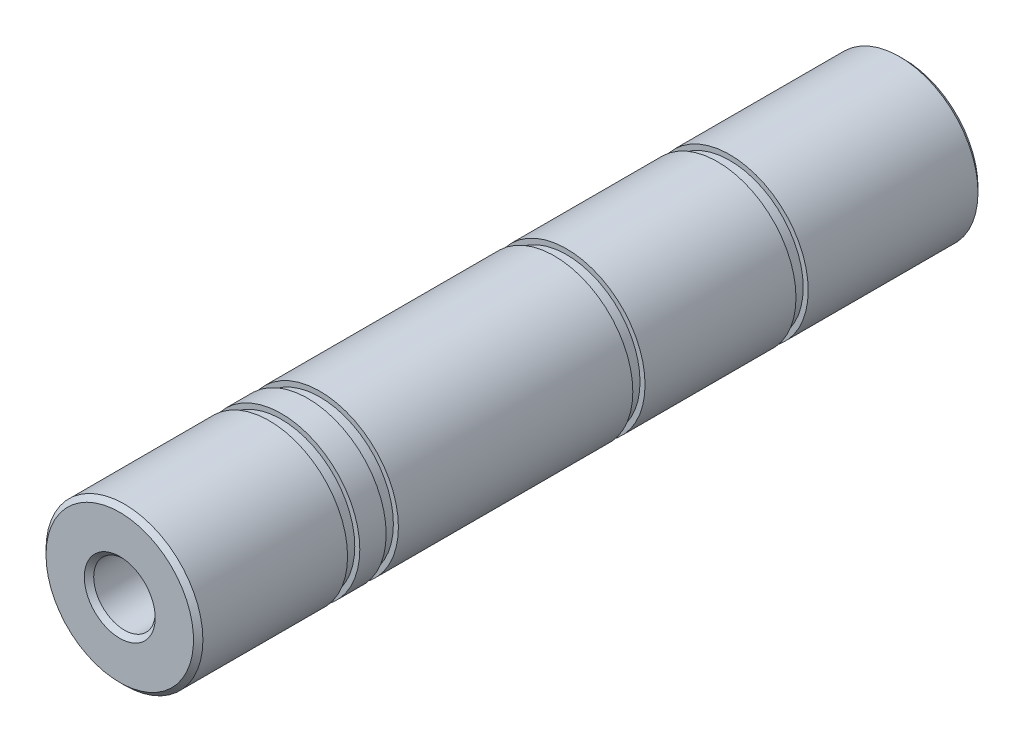
ISO-10303-21;
HEADER;
FILE_DESCRIPTION(('STEP AP214'),'2;1');
FILE_NAME('part.step','',(''),(''),'','','');
FILE_SCHEMA(('AUTOMOTIVE_DESIGN { 1 0 10303 214 1 1 1 1 }'));
ENDSEC;
DATA;
#1=APPLICATION_CONTEXT('core data for automotive mechanical design processes');
#2=APPLICATION_PROTOCOL_DEFINITION('international standard','automotive_design',2000,#1);
#3=PRODUCT_CONTEXT('',#1,'mechanical');
#4=PRODUCT('Part','Part','',(#3));
#5=PRODUCT_RELATED_PRODUCT_CATEGORY('part','',(#4));
#6=PRODUCT_DEFINITION_FORMATION('','',#4);
#7=PRODUCT_DEFINITION_CONTEXT('part definition',#1,'design');
#8=PRODUCT_DEFINITION('design','',#6,#7);
#9=PRODUCT_DEFINITION_SHAPE('','',#8);
#10=(LENGTH_UNIT() NAMED_UNIT(*) SI_UNIT(.MILLI.,.METRE.));
#11=(NAMED_UNIT(*) PLANE_ANGLE_UNIT() SI_UNIT($,.RADIAN.));
#12=(NAMED_UNIT(*) SI_UNIT($,.STERADIAN.) SOLID_ANGLE_UNIT());
#13=UNCERTAINTY_MEASURE_WITH_UNIT(LENGTH_MEASURE(1.E-05),#10,'distance_accuracy_value','');
#14=(GEOMETRIC_REPRESENTATION_CONTEXT(3) GLOBAL_UNCERTAINTY_ASSIGNED_CONTEXT((#13)) GLOBAL_UNIT_ASSIGNED_CONTEXT((#10,
#11,#12)) REPRESENTATION_CONTEXT('',''));
#15=CARTESIAN_POINT('',(0.,0.,0.));
#16=DIRECTION('',(0.,0.,1.));
#17=DIRECTION('',(1.,0.,0.));
#18=AXIS2_PLACEMENT_3D('',#15,#16,#17);
#19=CARTESIAN_POINT('',(0.,0.,44.4500000013477));
#20=DIRECTION('',(0.,0.,1.));
#21=DIRECTION('',(1.,0.,0.));
#22=AXIS2_PLACEMENT_3D('',#19,#20,#21);
#23=CONICAL_SURFACE('',#22,2.4891999989336,1.02974425733867);
#24=CARTESIAN_POINT('',(-2.27373675443232E-10,0.,42.954337744959));
#25=VERTEX_POINT('',#24);
#26=VERTEX_LOOP('',#25);
#27=FACE_BOUND('',#26,.T.);
#28=CARTESIAN_POINT('',(0.,0.,44.45));
#29=DIRECTION('',(0.,0.,1.));
#30=DIRECTION('',(1.,0.,0.));
#31=AXIS2_PLACEMENT_3D('',#28,#29,#30);
#32=CIRCLE('',#31,2.4892);
#33=CARTESIAN_POINT('',(2.4892,0.,44.45));
#34=VERTEX_POINT('',#33);
#35=EDGE_CURVE('E37',#34,#34,#32,.T.);
#36=ORIENTED_EDGE('',*,*,#35,.T.);
#37=EDGE_LOOP('',(#36));
#38=FACE_BOUND('',#37,.T.);
#39=ADVANCED_FACE('F17',(#27,#38),#23,.F.);
#40=CARTESIAN_POINT('',(0.,0.,19.0499999985718));
#41=DIRECTION('',(0.,0.,-1.));
#42=DIRECTION('',(-1.,0.,0.));
#43=AXIS2_PLACEMENT_3D('',#40,#41,#42);
#44=CONICAL_SURFACE('',#43,2.48919999899044,1.02974425739578);
#45=CARTESIAN_POINT('',(1.13686837721616E-10,0.,20.5456622549036));
#46=VERTEX_POINT('',#45);
#47=VERTEX_LOOP('',#46);
#48=FACE_BOUND('',#47,.T.);
#49=CARTESIAN_POINT('',(0.,0.,19.05));
#50=DIRECTION('',(0.,0.,-1.));
#51=DIRECTION('',(-1.,0.,0.));
#52=AXIS2_PLACEMENT_3D('',#49,#50,#51);
#53=CIRCLE('',#52,2.4892);
#54=CARTESIAN_POINT('',(-2.4892,0.,19.05));
#55=VERTEX_POINT('',#54);
#56=EDGE_CURVE('E39',#55,#55,#53,.T.);
#57=ORIENTED_EDGE('',*,*,#56,.T.);
#58=EDGE_LOOP('',(#57));
#59=FACE_BOUND('',#58,.T.);
#60=ADVANCED_FACE('F34',(#48,#59),#44,.F.);
#61=CARTESIAN_POINT('',(0.,0.,53.975));
#62=DIRECTION('',(0.,0.,1.));
#63=DIRECTION('',(1.,0.,0.));
#64=AXIS2_PLACEMENT_3D('',#61,#62,#63);
#65=CYLINDRICAL_SURFACE('',#64,2.4892);
#66=CARTESIAN_POINT('',(0.,0.,63.1189999999151));
#67=DIRECTION('',(0.,0.,1.));
#68=DIRECTION('',(-1.,0.,0.));
#69=AXIS2_PLACEMENT_3D('',#66,#67,#68);
#70=CIRCLE('',#69,2.48920000018416);
#71=CARTESIAN_POINT('',(-2.48920000018416,0.,63.1189999999151));
#72=VERTEX_POINT('',#71);
#73=EDGE_CURVE('E42',#72,#72,#70,.T.);
#74=ORIENTED_EDGE('',*,*,#73,.T.);
#75=EDGE_LOOP('',(#74));
#76=FACE_BOUND('',#75,.T.);
#77=ORIENTED_EDGE('',*,*,#35,.F.);
#78=EDGE_LOOP('',(#77));
#79=FACE_BOUND('',#78,.T.);
#80=ADVANCED_FACE('F368',(#76,#79),#65,.F.);
#81=CARTESIAN_POINT('',(0.,0.,9.525));
#82=DIRECTION('',(0.,0.,-1.));
#83=DIRECTION('',(-1.,0.,0.));
#84=AXIS2_PLACEMENT_3D('',#81,#82,#83);
#85=CYLINDRICAL_SURFACE('',#84,2.4892);
#86=CARTESIAN_POINT('',(0.,0.,0.381000000118092));
#87=DIRECTION('',(0.,0.,-1.));
#88=DIRECTION('',(1.,0.,0.));
#89=AXIS2_PLACEMENT_3D('',#86,#87,#88);
#90=CIRCLE('',#89,2.48920000012731);
#91=CARTESIAN_POINT('',(2.48920000012731,0.,0.381000000118092));
#92=VERTEX_POINT('',#91);
#93=EDGE_CURVE('E105',#92,#92,#90,.T.);
#94=ORIENTED_EDGE('',*,*,#93,.T.);
#95=EDGE_LOOP('',(#94));
#96=FACE_BOUND('',#95,.T.);
#97=ORIENTED_EDGE('',*,*,#56,.F.);
#98=EDGE_LOOP('',(#97));
#99=FACE_BOUND('',#98,.T.);
#100=ADVANCED_FACE('F360',(#96,#99),#85,.F.);
#101=CARTESIAN_POINT('',(0.,0.,63.5000000002037));
#102=DIRECTION('',(0.,0.,1.));
#103=DIRECTION('',(1.,0.,0.));
#104=AXIS2_PLACEMENT_3D('',#101,#102,#103);
#105=CONICAL_SURFACE('',#104,2.87019999979066,0.785398162502276);
#106=CARTESIAN_POINT('',(0.,0.,63.5000000002037));
#107=DIRECTION('',(0.,0.,1.));
#108=DIRECTION('',(1.,0.,0.));
#109=AXIS2_PLACEMENT_3D('',#106,#107,#108);
#110=CIRCLE('',#109,2.87019999979066);
#111=CARTESIAN_POINT('',(2.87019999979066,0.,63.5000000002037));
#112=VERTEX_POINT('',#111);
#113=EDGE_CURVE('E20',#112,#112,#110,.T.);
#114=ORIENTED_EDGE('',*,*,#113,.T.);
#115=EDGE_LOOP('',(#114));
#116=FACE_BOUND('',#115,.T.);
#117=ORIENTED_EDGE('',*,*,#73,.F.);
#118=EDGE_LOOP('',(#117));
#119=FACE_BOUND('',#118,.T.);
#120=ADVANCED_FACE('F351',(#116,#119),#105,.F.);
#121=CARTESIAN_POINT('',(0.,0.,-2.8421709430404E-10));
#122=DIRECTION('',(0.,0.,-1.));
#123=DIRECTION('',(-1.,0.,0.));
#124=AXIS2_PLACEMENT_3D('',#121,#122,#123);
#125=CONICAL_SURFACE('',#124,2.8701999998475,0.785398162502276);
#126=CARTESIAN_POINT('',(0.,0.,-2.27373675443232E-10));
#127=DIRECTION('',(0.,0.,-1.));
#128=DIRECTION('',(-1.,0.,0.));
#129=AXIS2_PLACEMENT_3D('',#126,#127,#128);
#130=CIRCLE('',#129,2.87019999979066);
#131=CARTESIAN_POINT('',(-2.87019999979066,0.,-2.27373675443232E-10));
#132=VERTEX_POINT('',#131);
#133=EDGE_CURVE('E100',#132,#132,#130,.F.);
#134=ORIENTED_EDGE('',*,*,#133,.F.);
#135=EDGE_LOOP('',(#134));
#136=FACE_BOUND('',#135,.T.);
#137=ORIENTED_EDGE('',*,*,#93,.F.);
#138=EDGE_LOOP('',(#137));
#139=FACE_BOUND('',#138,.T.);
#140=ADVANCED_FACE('F342',(#136,#139),#125,.F.);
#141=CARTESIAN_POINT('',(0.,0.,63.5));
#142=DIRECTION('',(0.,0.,-1.));
#143=DIRECTION('',(-1.,0.,0.));
#144=AXIS2_PLACEMENT_3D('',#141,#142,#143);
#145=PLANE('',#144);
#146=ORIENTED_EDGE('',*,*,#113,.F.);
#147=EDGE_LOOP('',(#146));
#148=FACE_BOUND('',#147,.T.);
#149=CARTESIAN_POINT('',(0.,0.,63.5000000001469));
#150=DIRECTION('',(0.,0.,-1.));
#151=DIRECTION('',(-1.,0.,0.));
#152=AXIS2_PLACEMENT_3D('',#149,#150,#151);
#153=CIRCLE('',#152,5.9690000002206);
#154=CARTESIAN_POINT('',(-5.9690000002206,0.,63.5000000001469));
#155=VERTEX_POINT('',#154);
#156=EDGE_CURVE('E98',#155,#155,#153,.T.);
#157=ORIENTED_EDGE('',*,*,#156,.F.);
#158=EDGE_LOOP('',(#157));
#159=FACE_BOUND('',#158,.T.);
#160=ADVANCED_FACE('F334',(#148,#159),#145,.F.);
#161=CARTESIAN_POINT('',(0.,0.,0.));
#162=DIRECTION('',(0.,0.,-1.));
#163=DIRECTION('',(-1.,0.,0.));
#164=AXIS2_PLACEMENT_3D('',#161,#162,#163);
#165=PLANE('',#164);
#166=ORIENTED_EDGE('',*,*,#133,.T.);
#167=EDGE_LOOP('',(#166));
#168=FACE_BOUND('',#167,.T.);
#169=CARTESIAN_POINT('',(0.,0.,-1.70530256582424E-10));
#170=DIRECTION('',(0.,0.,1.));
#171=DIRECTION('',(1.,0.,0.));
#172=AXIS2_PLACEMENT_3D('',#169,#170,#171);
#173=CIRCLE('',#172,5.9690000002206);
#174=CARTESIAN_POINT('',(5.9690000002206,0.,-1.70530256582424E-10));
#175=VERTEX_POINT('',#174);
#176=EDGE_CURVE('E94',#175,#175,#173,.T.);
#177=ORIENTED_EDGE('',*,*,#176,.F.);
#178=EDGE_LOOP('',(#177));
#179=FACE_BOUND('',#178,.T.);
#180=ADVANCED_FACE('F144',(#168,#179),#165,.T.);
#181=CARTESIAN_POINT('',(0.,0.,63.1189999999151));
#182=DIRECTION('',(0.,0.,-1.));
#183=DIRECTION('',(-1.,0.,0.));
#184=AXIS2_PLACEMENT_3D('',#181,#182,#183);
#185=CONICAL_SURFACE('',#184,6.34999999977026,0.785398162502276);
#186=CARTESIAN_POINT('',(0.,0.,63.119));
#187=DIRECTION('',(0.,0.,1.));
#188=DIRECTION('',(1.,0.,0.));
#189=AXIS2_PLACEMENT_3D('',#186,#187,#188);
#190=CIRCLE('',#189,6.35);
#191=CARTESIAN_POINT('',(6.35,0.,63.119));
#192=VERTEX_POINT('',#191);
#193=EDGE_CURVE('E97',#192,#192,#190,.F.);
#194=ORIENTED_EDGE('',*,*,#193,.F.);
#195=EDGE_LOOP('',(#194));
#196=FACE_BOUND('',#195,.T.);
#197=ORIENTED_EDGE('',*,*,#156,.T.);
#198=EDGE_LOOP('',(#197));
#199=FACE_BOUND('',#198,.T.);
#200=ADVANCED_FACE('F134',(#196,#199),#185,.T.);
#201=CARTESIAN_POINT('',(0.,0.,0.381000000174936));
#202=DIRECTION('',(0.,0.,1.));
#203=DIRECTION('',(1.,0.,0.));
#204=AXIS2_PLACEMENT_3D('',#201,#202,#203);
#205=CONICAL_SURFACE('',#204,6.34999999988395,0.785398162502276);
#206=ORIENTED_EDGE('',*,*,#176,.T.);
#207=EDGE_LOOP('',(#206));
#208=FACE_BOUND('',#207,.T.);
#209=CARTESIAN_POINT('',(0.,0.,0.381));
#210=DIRECTION('',(0.,0.,1.));
#211=DIRECTION('',(1.,0.,0.));
#212=AXIS2_PLACEMENT_3D('',#209,#210,#211);
#213=CIRCLE('',#212,6.35);
#214=CARTESIAN_POINT('',(6.35,0.,0.381));
#215=VERTEX_POINT('',#214);
#216=EDGE_CURVE('E93',#215,#215,#213,.T.);
#217=ORIENTED_EDGE('',*,*,#216,.F.);
#218=EDGE_LOOP('',(#217));
#219=FACE_BOUND('',#218,.T.);
#220=ADVANCED_FACE('F131',(#208,#219),#205,.T.);
#221=CARTESIAN_POINT('',(0.,0.,0.));
#222=DIRECTION('',(0.,0.,1.));
#223=DIRECTION('',(1.,0.,0.));
#224=AXIS2_PLACEMENT_3D('',#221,#222,#223);
#225=CYLINDRICAL_SURFACE('',#224,6.35);
#226=ORIENTED_EDGE('',*,*,#193,.T.);
#227=EDGE_LOOP('',(#226));
#228=FACE_BOUND('',#227,.T.);
#229=CARTESIAN_POINT('',(0.,0.,51.4096));
#230=DIRECTION('',(0.,0.,1.));
#231=DIRECTION('',(1.,0.,0.));
#232=AXIS2_PLACEMENT_3D('',#229,#230,#231);
#233=CIRCLE('',#232,6.35);
#234=CARTESIAN_POINT('',(6.35,0.,51.4096));
#235=VERTEX_POINT('',#234);
#236=EDGE_CURVE('E90',#235,#235,#233,.T.);
#237=ORIENTED_EDGE('',*,*,#236,.T.);
#238=EDGE_LOOP('',(#237));
#239=FACE_BOUND('',#238,.T.);
#240=ADVANCED_FACE('F133',(#228,#239),#225,.T.);
#241=CARTESIAN_POINT('',(0.,0.,0.));
#242=DIRECTION('',(0.,0.,1.));
#243=DIRECTION('',(1.,0.,0.));
#244=AXIS2_PLACEMENT_3D('',#241,#242,#243);
#245=CYLINDRICAL_SURFACE('',#244,6.35);
#246=ORIENTED_EDGE('',*,*,#216,.T.);
#247=EDGE_LOOP('',(#246));
#248=FACE_BOUND('',#247,.T.);
#249=CARTESIAN_POINT('',(0.,0.,14.1224));
#250=DIRECTION('',(0.,0.,1.));
#251=DIRECTION('',(1.,0.,0.));
#252=AXIS2_PLACEMENT_3D('',#249,#250,#251);
#253=CIRCLE('',#252,6.35);
#254=CARTESIAN_POINT('',(6.35,0.,14.1224));
#255=VERTEX_POINT('',#254);
#256=EDGE_CURVE('E87',#255,#255,#253,.F.);
#257=ORIENTED_EDGE('',*,*,#256,.T.);
#258=EDGE_LOOP('',(#257));
#259=FACE_BOUND('',#258,.T.);
#260=ADVANCED_FACE('F128',(#248,#259),#245,.T.);
#261=CARTESIAN_POINT('',(-6.1468,0.,51.4096));
#262=DIRECTION('',(0.,0.,1.));
#263=DIRECTION('',(1.,0.,0.));
#264=AXIS2_PLACEMENT_3D('',#261,#262,#263);
#265=PLANE('',#264);
#266=CARTESIAN_POINT('',(0.,0.,51.4096));
#267=DIRECTION('',(0.,0.,1.));
#268=DIRECTION('',(1.,0.,0.));
#269=AXIS2_PLACEMENT_3D('',#266,#267,#268);
#270=CIRCLE('',#269,5.9436);
#271=CARTESIAN_POINT('',(5.9436,0.,51.4096));
#272=VERTEX_POINT('',#271);
#273=EDGE_CURVE('E84',#272,#272,#270,.F.);
#274=ORIENTED_EDGE('',*,*,#273,.F.);
#275=EDGE_LOOP('',(#274));
#276=FACE_BOUND('',#275,.T.);
#277=ORIENTED_EDGE('',*,*,#236,.F.);
#278=EDGE_LOOP('',(#277));
#279=FACE_BOUND('',#278,.T.);
#280=ADVANCED_FACE('F206',(#276,#279),#265,.F.);
#281=CARTESIAN_POINT('',(-6.1468,0.,14.1224));
#282=DIRECTION('',(0.,0.,-1.));
#283=DIRECTION('',(-1.,0.,0.));
#284=AXIS2_PLACEMENT_3D('',#281,#282,#283);
#285=PLANE('',#284);
#286=CARTESIAN_POINT('',(0.,0.,14.1224));
#287=DIRECTION('',(0.,0.,1.));
#288=DIRECTION('',(1.,0.,0.));
#289=AXIS2_PLACEMENT_3D('',#286,#287,#288);
#290=CIRCLE('',#289,5.9436);
#291=CARTESIAN_POINT('',(5.9436,0.,14.1224));
#292=VERTEX_POINT('',#291);
#293=EDGE_CURVE('E81',#292,#292,#290,.T.);
#294=ORIENTED_EDGE('',*,*,#293,.F.);
#295=EDGE_LOOP('',(#294));
#296=FACE_BOUND('',#295,.T.);
#297=ORIENTED_EDGE('',*,*,#256,.F.);
#298=EDGE_LOOP('',(#297));
#299=FACE_BOUND('',#298,.T.);
#300=ADVANCED_FACE('F202',(#296,#299),#285,.F.);
#301=CARTESIAN_POINT('',(0.,0.,50.9143));
#302=DIRECTION('',(0.,0.,1.));
#303=DIRECTION('',(1.,0.,0.));
#304=AXIS2_PLACEMENT_3D('',#301,#302,#303);
#305=CYLINDRICAL_SURFACE('',#304,5.9436);
#306=ORIENTED_EDGE('',*,*,#273,.T.);
#307=EDGE_LOOP('',(#306));
#308=FACE_BOUND('',#307,.T.);
#309=CARTESIAN_POINT('',(0.,0.,50.419));
#310=DIRECTION('',(0.,0.,1.));
#311=DIRECTION('',(1.,0.,0.));
#312=AXIS2_PLACEMENT_3D('',#309,#310,#311);
#313=CIRCLE('',#312,5.9436);
#314=CARTESIAN_POINT('',(5.9436,0.,50.419));
#315=VERTEX_POINT('',#314);
#316=EDGE_CURVE('E78',#315,#315,#313,.T.);
#317=ORIENTED_EDGE('',*,*,#316,.T.);
#318=EDGE_LOOP('',(#317));
#319=FACE_BOUND('',#318,.T.);
#320=ADVANCED_FACE('F198',(#308,#319),#305,.T.);
#321=CARTESIAN_POINT('',(0.,0.,14.6177));
#322=DIRECTION('',(0.,0.,1.));
#323=DIRECTION('',(1.,0.,0.));
#324=AXIS2_PLACEMENT_3D('',#321,#322,#323);
#325=CYLINDRICAL_SURFACE('',#324,5.9436);
#326=CARTESIAN_POINT('',(0.,0.,15.113));
#327=DIRECTION('',(0.,0.,1.));
#328=DIRECTION('',(1.,0.,0.));
#329=AXIS2_PLACEMENT_3D('',#326,#327,#328);
#330=CIRCLE('',#329,5.9436);
#331=CARTESIAN_POINT('',(5.9436,0.,15.113));
#332=VERTEX_POINT('',#331);
#333=EDGE_CURVE('E75',#332,#332,#330,.F.);
#334=ORIENTED_EDGE('',*,*,#333,.T.);
#335=EDGE_LOOP('',(#334));
#336=FACE_BOUND('',#335,.T.);
#337=ORIENTED_EDGE('',*,*,#293,.T.);
#338=EDGE_LOOP('',(#337));
#339=FACE_BOUND('',#338,.T.);
#340=ADVANCED_FACE('F194',(#336,#339),#325,.T.);
#341=CARTESIAN_POINT('',(-6.1468,0.,50.419));
#342=DIRECTION('',(0.,0.,-1.));
#343=DIRECTION('',(-1.,0.,0.));
#344=AXIS2_PLACEMENT_3D('',#341,#342,#343);
#345=PLANE('',#344);
#346=ORIENTED_EDGE('',*,*,#316,.F.);
#347=EDGE_LOOP('',(#346));
#348=FACE_BOUND('',#347,.T.);
#349=CARTESIAN_POINT('',(0.,0.,50.419));
#350=DIRECTION('',(0.,0.,1.));
#351=DIRECTION('',(1.,0.,0.));
#352=AXIS2_PLACEMENT_3D('',#349,#350,#351);
#353=CIRCLE('',#352,6.35);
#354=CARTESIAN_POINT('',(6.35,0.,50.419));
#355=VERTEX_POINT('',#354);
#356=EDGE_CURVE('E72',#355,#355,#353,.F.);
#357=ORIENTED_EDGE('',*,*,#356,.F.);
#358=EDGE_LOOP('',(#357));
#359=FACE_BOUND('',#358,.T.);
#360=ADVANCED_FACE('F190',(#348,#359),#345,.F.);
#361=CARTESIAN_POINT('',(-6.1468,0.,15.113));
#362=DIRECTION('',(0.,0.,1.));
#363=DIRECTION('',(1.,0.,0.));
#364=AXIS2_PLACEMENT_3D('',#361,#362,#363);
#365=PLANE('',#364);
#366=ORIENTED_EDGE('',*,*,#333,.F.);
#367=EDGE_LOOP('',(#366));
#368=FACE_BOUND('',#367,.T.);
#369=CARTESIAN_POINT('',(0.,0.,15.113));
#370=DIRECTION('',(0.,0.,1.));
#371=DIRECTION('',(1.,0.,0.));
#372=AXIS2_PLACEMENT_3D('',#369,#370,#371);
#373=CIRCLE('',#372,6.35);
#374=CARTESIAN_POINT('',(6.35,0.,15.113));
#375=VERTEX_POINT('',#374);
#376=EDGE_CURVE('E69',#375,#375,#373,.T.);
#377=ORIENTED_EDGE('',*,*,#376,.F.);
#378=EDGE_LOOP('',(#377));
#379=FACE_BOUND('',#378,.T.);
#380=ADVANCED_FACE('F186',(#368,#379),#365,.F.);
#381=CARTESIAN_POINT('',(0.,0.,0.));
#382=DIRECTION('',(0.,0.,1.));
#383=DIRECTION('',(1.,0.,0.));
#384=AXIS2_PLACEMENT_3D('',#381,#382,#383);
#385=CYLINDRICAL_SURFACE('',#384,6.35);
#386=CARTESIAN_POINT('',(0.,0.,48.2854));
#387=DIRECTION('',(0.,0.,1.));
#388=DIRECTION('',(1.,0.,0.));
#389=AXIS2_PLACEMENT_3D('',#386,#387,#388);
#390=CIRCLE('',#389,6.35);
#391=CARTESIAN_POINT('',(6.35,0.,48.2854));
#392=VERTEX_POINT('',#391);
#393=EDGE_CURVE('E66',#392,#392,#390,.T.);
#394=ORIENTED_EDGE('',*,*,#393,.T.);
#395=EDGE_LOOP('',(#394));
#396=FACE_BOUND('',#395,.T.);
#397=ORIENTED_EDGE('',*,*,#356,.T.);
#398=EDGE_LOOP('',(#397));
#399=FACE_BOUND('',#398,.T.);
#400=ADVANCED_FACE('F182',(#396,#399),#385,.T.);
#401=CARTESIAN_POINT('',(0.,0.,0.));
#402=DIRECTION('',(0.,0.,1.));
#403=DIRECTION('',(1.,0.,0.));
#404=AXIS2_PLACEMENT_3D('',#401,#402,#403);
#405=CYLINDRICAL_SURFACE('',#404,6.35);
#406=CARTESIAN_POINT('',(0.,0.,27.3304));
#407=DIRECTION('',(0.,0.,1.));
#408=DIRECTION('',(1.,0.,0.));
#409=AXIS2_PLACEMENT_3D('',#406,#407,#408);
#410=CIRCLE('',#409,6.35);
#411=CARTESIAN_POINT('',(6.35,0.,27.3304));
#412=VERTEX_POINT('',#411);
#413=EDGE_CURVE('E63',#412,#412,#410,.F.);
#414=ORIENTED_EDGE('',*,*,#413,.T.);
#415=EDGE_LOOP('',(#414));
#416=FACE_BOUND('',#415,.T.);
#417=ORIENTED_EDGE('',*,*,#376,.T.);
#418=EDGE_LOOP('',(#417));
#419=FACE_BOUND('',#418,.T.);
#420=ADVANCED_FACE('F178',(#416,#419),#405,.T.);
#421=CARTESIAN_POINT('',(-6.1468,0.,48.2854));
#422=DIRECTION('',(0.,0.,1.));
#423=DIRECTION('',(1.,0.,0.));
#424=AXIS2_PLACEMENT_3D('',#421,#422,#423);
#425=PLANE('',#424);
#426=CARTESIAN_POINT('',(0.,0.,48.2854));
#427=DIRECTION('',(0.,0.,1.));
#428=DIRECTION('',(1.,0.,0.));
#429=AXIS2_PLACEMENT_3D('',#426,#427,#428);
#430=CIRCLE('',#429,5.9436);
#431=CARTESIAN_POINT('',(5.9436,0.,48.2854));
#432=VERTEX_POINT('',#431);
#433=EDGE_CURVE('E60',#432,#432,#430,.F.);
#434=ORIENTED_EDGE('',*,*,#433,.F.);
#435=EDGE_LOOP('',(#434));
#436=FACE_BOUND('',#435,.T.);
#437=ORIENTED_EDGE('',*,*,#393,.F.);
#438=EDGE_LOOP('',(#437));
#439=FACE_BOUND('',#438,.T.);
#440=ADVANCED_FACE('F174',(#436,#439),#425,.F.);
#441=CARTESIAN_POINT('',(-6.1468,0.,27.3304));
#442=DIRECTION('',(0.,0.,-1.));
#443=DIRECTION('',(-1.,0.,0.));
#444=AXIS2_PLACEMENT_3D('',#441,#442,#443);
#445=PLANE('',#444);
#446=CARTESIAN_POINT('',(0.,0.,27.3304));
#447=DIRECTION('',(0.,0.,1.));
#448=DIRECTION('',(1.,0.,0.));
#449=AXIS2_PLACEMENT_3D('',#446,#447,#448);
#450=CIRCLE('',#449,5.9436);
#451=CARTESIAN_POINT('',(5.9436,0.,27.3304));
#452=VERTEX_POINT('',#451);
#453=EDGE_CURVE('E57',#452,#452,#450,.T.);
#454=ORIENTED_EDGE('',*,*,#453,.F.);
#455=EDGE_LOOP('',(#454));
#456=FACE_BOUND('',#455,.T.);
#457=ORIENTED_EDGE('',*,*,#413,.F.);
#458=EDGE_LOOP('',(#457));
#459=FACE_BOUND('',#458,.T.);
#460=ADVANCED_FACE('F170',(#456,#459),#445,.F.);
#461=CARTESIAN_POINT('',(0.,0.,47.7901));
#462=DIRECTION('',(0.,0.,1.));
#463=DIRECTION('',(1.,0.,0.));
#464=AXIS2_PLACEMENT_3D('',#461,#462,#463);
#465=CYLINDRICAL_SURFACE('',#464,5.9436);
#466=ORIENTED_EDGE('',*,*,#433,.T.);
#467=EDGE_LOOP('',(#466));
#468=FACE_BOUND('',#467,.T.);
#469=CARTESIAN_POINT('',(0.,0.,47.2948));
#470=DIRECTION('',(0.,0.,1.));
#471=DIRECTION('',(1.,0.,0.));
#472=AXIS2_PLACEMENT_3D('',#469,#470,#471);
#473=CIRCLE('',#472,5.9436);
#474=CARTESIAN_POINT('',(5.9436,0.,47.2948));
#475=VERTEX_POINT('',#474);
#476=EDGE_CURVE('E54',#475,#475,#473,.T.);
#477=ORIENTED_EDGE('',*,*,#476,.T.);
#478=EDGE_LOOP('',(#477));
#479=FACE_BOUND('',#478,.T.);
#480=ADVANCED_FACE('F166',(#468,#479),#465,.T.);
#481=CARTESIAN_POINT('',(0.,0.,27.8257));
#482=DIRECTION('',(0.,0.,1.));
#483=DIRECTION('',(1.,0.,0.));
#484=AXIS2_PLACEMENT_3D('',#481,#482,#483);
#485=CYLINDRICAL_SURFACE('',#484,5.9436);
#486=CARTESIAN_POINT('',(0.,0.,28.321));
#487=DIRECTION('',(0.,0.,1.));
#488=DIRECTION('',(1.,0.,0.));
#489=AXIS2_PLACEMENT_3D('',#486,#487,#488);
#490=CIRCLE('',#489,5.9436);
#491=CARTESIAN_POINT('',(5.9436,0.,28.321));
#492=VERTEX_POINT('',#491);
#493=EDGE_CURVE('E51',#492,#492,#490,.F.);
#494=ORIENTED_EDGE('',*,*,#493,.T.);
#495=EDGE_LOOP('',(#494));
#496=FACE_BOUND('',#495,.T.);
#497=ORIENTED_EDGE('',*,*,#453,.T.);
#498=EDGE_LOOP('',(#497));
#499=FACE_BOUND('',#498,.T.);
#500=ADVANCED_FACE('F162',(#496,#499),#485,.T.);
#501=CARTESIAN_POINT('',(-6.1468,0.,47.2948));
#502=DIRECTION('',(0.,0.,-1.));
#503=DIRECTION('',(-1.,0.,0.));
#504=AXIS2_PLACEMENT_3D('',#501,#502,#503);
#505=PLANE('',#504);
#506=ORIENTED_EDGE('',*,*,#476,.F.);
#507=EDGE_LOOP('',(#506));
#508=FACE_BOUND('',#507,.T.);
#509=CARTESIAN_POINT('',(0.,0.,47.2948));
#510=DIRECTION('',(0.,0.,1.));
#511=DIRECTION('',(1.,0.,0.));
#512=AXIS2_PLACEMENT_3D('',#509,#510,#511);
#513=CIRCLE('',#512,6.35);
#514=CARTESIAN_POINT('',(6.35,0.,47.2948));
#515=VERTEX_POINT('',#514);
#516=EDGE_CURVE('E26',#515,#515,#513,.F.);
#517=ORIENTED_EDGE('',*,*,#516,.F.);
#518=EDGE_LOOP('',(#517));
#519=FACE_BOUND('',#518,.T.);
#520=ADVANCED_FACE('F155',(#508,#519),#505,.F.);
#521=CARTESIAN_POINT('',(-6.1468,0.,28.321));
#522=DIRECTION('',(0.,0.,1.));
#523=DIRECTION('',(1.,0.,0.));
#524=AXIS2_PLACEMENT_3D('',#521,#522,#523);
#525=PLANE('',#524);
#526=ORIENTED_EDGE('',*,*,#493,.F.);
#527=EDGE_LOOP('',(#526));
#528=FACE_BOUND('',#527,.T.);
#529=CARTESIAN_POINT('',(0.,0.,28.321));
#530=DIRECTION('',(0.,0.,1.));
#531=DIRECTION('',(1.,0.,0.));
#532=AXIS2_PLACEMENT_3D('',#529,#530,#531);
#533=CIRCLE('',#532,6.35);
#534=CARTESIAN_POINT('',(6.35,0.,28.321));
#535=VERTEX_POINT('',#534);
#536=EDGE_CURVE('E11',#535,#535,#533,.T.);
#537=ORIENTED_EDGE('',*,*,#536,.F.);
#538=EDGE_LOOP('',(#537));
#539=FACE_BOUND('',#538,.T.);
#540=ADVANCED_FACE('F149',(#528,#539),#525,.F.);
#541=CARTESIAN_POINT('',(0.,0.,0.));
#542=DIRECTION('',(0.,0.,1.));
#543=DIRECTION('',(1.,0.,0.));
#544=AXIS2_PLACEMENT_3D('',#541,#542,#543);
#545=CYLINDRICAL_SURFACE('',#544,6.35);
#546=ORIENTED_EDGE('',*,*,#536,.T.);
#547=EDGE_LOOP('',(#546));
#548=FACE_BOUND('',#547,.T.);
#549=ORIENTED_EDGE('',*,*,#516,.T.);
#550=EDGE_LOOP('',(#549));
#551=FACE_BOUND('',#550,.T.);
#552=ADVANCED_FACE('F147',(#548,#551),#545,.T.);
#553=CLOSED_SHELL('',(#39,#60,#80,#100,#120,#140,#160,#180,#200,#220,#240,#260,#280,#300,#320,
#340,#360,#380,#400,#420,#440,#460,#480,#500,#520,#540,#552));
#554=MANIFOLD_SOLID_BREP('B1',#553);
#555=ADVANCED_BREP_SHAPE_REPRESENTATION('',(#18,#554),#14);
#556=SHAPE_DEFINITION_REPRESENTATION(#9,#555);
ENDSEC;
END-ISO-10303-21;
